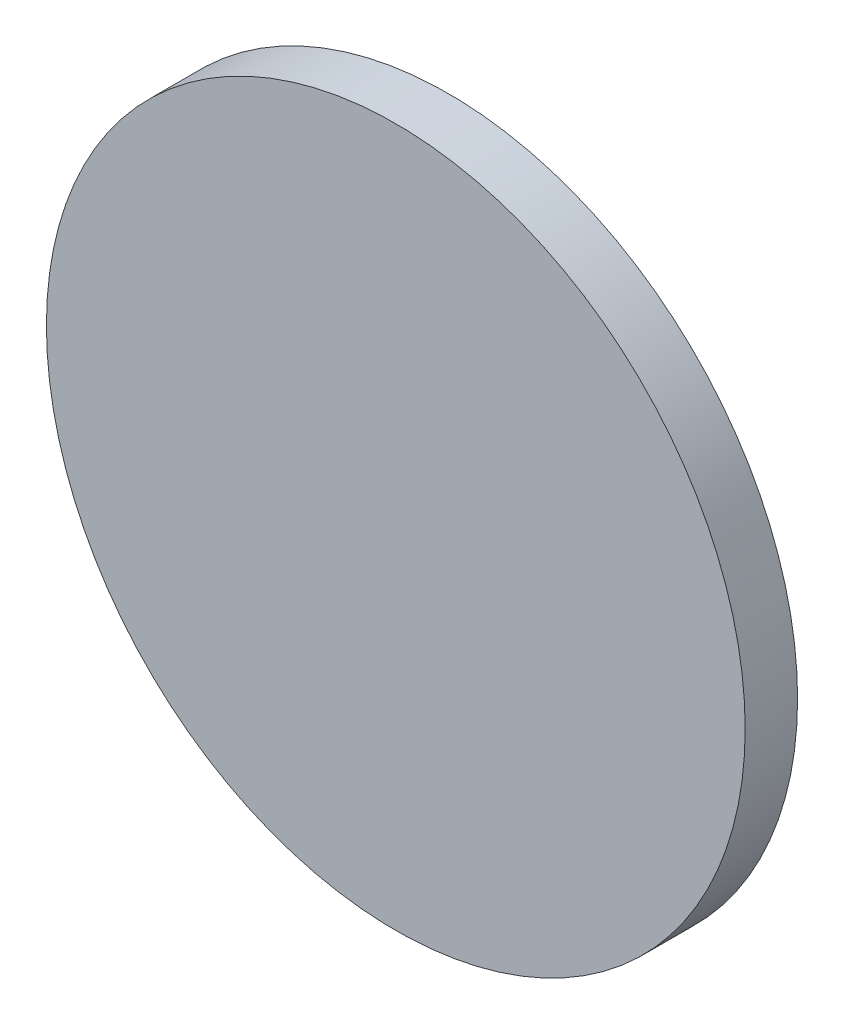
ISO-10303-21;
HEADER;
FILE_DESCRIPTION(('STEP AP214'),'2;1');
FILE_NAME('part.step','',(''),(''),'','','');
FILE_SCHEMA(('AUTOMOTIVE_DESIGN { 1 0 10303 214 1 1 1 1 }'));
ENDSEC;
DATA;
#1=APPLICATION_CONTEXT('core data for automotive mechanical design processes');
#2=APPLICATION_PROTOCOL_DEFINITION('international standard','automotive_design',2000,#1);
#3=PRODUCT_CONTEXT('',#1,'mechanical');
#4=PRODUCT('Part','Part','',(#3));
#5=PRODUCT_RELATED_PRODUCT_CATEGORY('part','',(#4));
#6=PRODUCT_DEFINITION_FORMATION('','',#4);
#7=PRODUCT_DEFINITION_CONTEXT('part definition',#1,'design');
#8=PRODUCT_DEFINITION('design','',#6,#7);
#9=PRODUCT_DEFINITION_SHAPE('','',#8);
#10=(LENGTH_UNIT() NAMED_UNIT(*) SI_UNIT(.MILLI.,.METRE.));
#11=(NAMED_UNIT(*) PLANE_ANGLE_UNIT() SI_UNIT($,.RADIAN.));
#12=(NAMED_UNIT(*) SI_UNIT($,.STERADIAN.) SOLID_ANGLE_UNIT());
#13=UNCERTAINTY_MEASURE_WITH_UNIT(LENGTH_MEASURE(1.E-05),#10,'distance_accuracy_value','');
#14=(GEOMETRIC_REPRESENTATION_CONTEXT(3) GLOBAL_UNCERTAINTY_ASSIGNED_CONTEXT((#13)) GLOBAL_UNIT_ASSIGNED_CONTEXT((#10,
#11,#12)) REPRESENTATION_CONTEXT('',''));
#15=CARTESIAN_POINT('',(0.,0.,0.));
#16=DIRECTION('',(0.,0.,1.));
#17=DIRECTION('',(1.,0.,0.));
#18=AXIS2_PLACEMENT_3D('',#15,#16,#17);
#19=CARTESIAN_POINT('',(4.15748,13.13473,0.79916));
#20=DIRECTION('',(0.,0.,1.));
#21=DIRECTION('',(1.,0.,0.));
#22=AXIS2_PLACEMENT_3D('',#19,#20,#21);
#23=PLANE('',#22);
#24=CARTESIAN_POINT('',(4.15748,13.13473,0.79916));
#25=DIRECTION('',(0.,0.,1.));
#26=DIRECTION('',(1.,0.,0.));
#27=AXIS2_PLACEMENT_3D('',#24,#25,#26);
#28=CIRCLE('',#27,0.2286);
#29=CARTESIAN_POINT('',(4.38608,13.13473,0.79916));
#30=VERTEX_POINT('',#29);
#31=EDGE_CURVE('E18',#30,#30,#28,.F.);
#32=ORIENTED_EDGE('',*,*,#31,.F.);
#33=EDGE_LOOP('',(#32));
#34=FACE_BOUND('',#33,.T.);
#35=ADVANCED_FACE('F15',(#34),#23,.T.);
#36=CARTESIAN_POINT('',(4.15748,13.13473,0.76487));
#37=DIRECTION('',(0.,0.,1.));
#38=DIRECTION('',(1.,0.,0.));
#39=AXIS2_PLACEMENT_3D('',#36,#37,#38);
#40=CYLINDRICAL_SURFACE('',#39,0.2286);
#41=ORIENTED_EDGE('',*,*,#31,.T.);
#42=EDGE_LOOP('',(#41));
#43=FACE_BOUND('',#42,.T.);
#44=CARTESIAN_POINT('',(4.15748,13.13473,0.76487));
#45=DIRECTION('',(0.,0.,1.));
#46=DIRECTION('',(1.,0.,0.));
#47=AXIS2_PLACEMENT_3D('',#44,#45,#46);
#48=CIRCLE('',#47,0.2286);
#49=CARTESIAN_POINT('',(4.38608,13.13473,0.76487));
#50=VERTEX_POINT('',#49);
#51=EDGE_CURVE('E10',#50,#50,#48,.F.);
#52=ORIENTED_EDGE('',*,*,#51,.F.);
#53=EDGE_LOOP('',(#52));
#54=FACE_BOUND('',#53,.T.);
#55=ADVANCED_FACE('F27',(#43,#54),#40,.T.);
#56=CARTESIAN_POINT('',(4.15748,13.13473,0.76487));
#57=DIRECTION('',(0.,0.,-1.));
#58=DIRECTION('',(-1.,0.,0.));
#59=AXIS2_PLACEMENT_3D('',#56,#57,#58);
#60=PLANE('',#59);
#61=ORIENTED_EDGE('',*,*,#51,.T.);
#62=EDGE_LOOP('',(#61));
#63=FACE_BOUND('',#62,.T.);
#64=ADVANCED_FACE('F35',(#63),#60,.T.);
#65=CLOSED_SHELL('',(#35,#55,#64));
#66=MANIFOLD_SOLID_BREP('B1',#65);
#67=ADVANCED_BREP_SHAPE_REPRESENTATION('',(#18,#66),#14);
#68=SHAPE_DEFINITION_REPRESENTATION(#9,#67);
ENDSEC;
END-ISO-10303-21;
